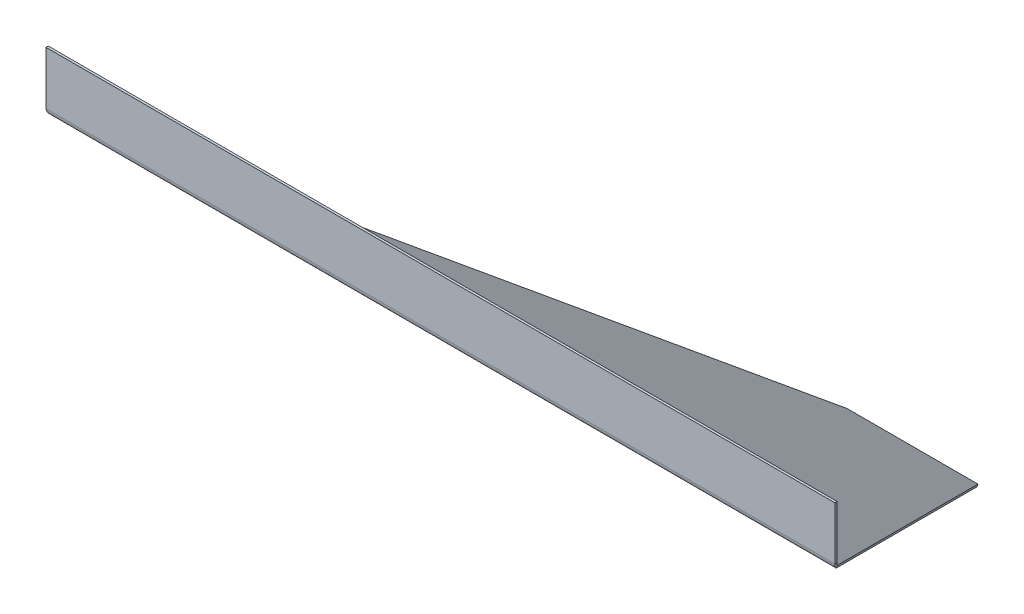
ISO-10303-21;
HEADER;
FILE_DESCRIPTION(('STEP AP214'),'2;1');
FILE_NAME('part.step','',(''),(''),'','','');
FILE_SCHEMA(('AUTOMOTIVE_DESIGN { 1 0 10303 214 1 1 1 1 }'));
ENDSEC;
DATA;
#1=APPLICATION_CONTEXT('core data for automotive mechanical design processes');
#2=APPLICATION_PROTOCOL_DEFINITION('international standard','automotive_design',2000,#1);
#3=PRODUCT_CONTEXT('',#1,'mechanical');
#4=PRODUCT('Part','Part','',(#3));
#5=PRODUCT_RELATED_PRODUCT_CATEGORY('part','',(#4));
#6=PRODUCT_DEFINITION_FORMATION('','',#4);
#7=PRODUCT_DEFINITION_CONTEXT('part definition',#1,'design');
#8=PRODUCT_DEFINITION('design','',#6,#7);
#9=PRODUCT_DEFINITION_SHAPE('','',#8);
#10=(LENGTH_UNIT() NAMED_UNIT(*) SI_UNIT(.MILLI.,.METRE.));
#11=(NAMED_UNIT(*) PLANE_ANGLE_UNIT() SI_UNIT($,.RADIAN.));
#12=(NAMED_UNIT(*) SI_UNIT($,.STERADIAN.) SOLID_ANGLE_UNIT());
#13=UNCERTAINTY_MEASURE_WITH_UNIT(LENGTH_MEASURE(1.E-05),#10,'distance_accuracy_value','');
#14=(GEOMETRIC_REPRESENTATION_CONTEXT(3) GLOBAL_UNCERTAINTY_ASSIGNED_CONTEXT((#13)) GLOBAL_UNIT_ASSIGNED_CONTEXT((#10,
#11,#12)) REPRESENTATION_CONTEXT('',''));
#15=CARTESIAN_POINT('',(0.,0.,0.));
#16=DIRECTION('',(0.,0.,1.));
#17=DIRECTION('',(1.,0.,0.));
#18=AXIS2_PLACEMENT_3D('',#15,#16,#17);
#19=CARTESIAN_POINT('',(-348.585786437627,341.373079461268,506.591069961946));
#20=DIRECTION('',(0.,-1.,0.));
#21=DIRECTION('',(-1.,0.,0.));
#22=AXIS2_PLACEMENT_3D('',#19,#20,#21);
#23=PLANE('',#22);
#24=DIRECTION('',(0.,0.,-1.));
#25=VECTOR('',#24,1.);
#26=CARTESIAN_POINT('',(-348.585786437627,341.373079461268,506.591069961946));
#27=LINE('',#26,#25);
#28=CARTESIAN_POINT('',(-348.58578643763,341.373079461271,508.591069961946));
#29=VERTEX_POINT('',#28);
#30=CARTESIAN_POINT('',(-348.585786437627,341.373079461268,506.591069961946));
#31=VERTEX_POINT('',#30);
#32=EDGE_CURVE('E11',#29,#31,#27,.T.);
#33=ORIENTED_EDGE('',*,*,#32,.F.);
#34=DIRECTION('',(-1.,0.,0.));
#35=VECTOR('',#34,1.);
#36=CARTESIAN_POINT('',(-4.49753559093629E-13,341.373079461271,508.591069961946));
#37=LINE('',#36,#35);
#38=CARTESIAN_POINT('',(348.585786437632,341.373079461271,508.591069961946));
#39=VERTEX_POINT('',#38);
#40=EDGE_CURVE('E127',#39,#29,#37,.T.);
#41=ORIENTED_EDGE('',*,*,#40,.F.);
#42=DIRECTION('',(0.,0.,-1.));
#43=VECTOR('',#42,1.);
#44=CARTESIAN_POINT('',(348.585786437629,341.373079461268,506.591069961946));
#45=LINE('',#44,#43);
#46=CARTESIAN_POINT('',(348.585786437629,341.373079461268,506.591069961946));
#47=VERTEX_POINT('',#46);
#48=EDGE_CURVE('E53',#39,#47,#45,.T.);
#49=ORIENTED_EDGE('',*,*,#48,.T.);
#50=DIRECTION('',(-1.,0.,0.));
#51=VECTOR('',#50,1.);
#52=CARTESIAN_POINT('',(-348.585786437627,341.373079461268,506.591069961946));
#53=LINE('',#52,#51);
#54=EDGE_CURVE('E275',#47,#31,#53,.T.);
#55=ORIENTED_EDGE('',*,*,#54,.T.);
#56=EDGE_LOOP('',(#33,#41,#49,#55));
#57=FACE_BOUND('',#56,.T.);
#58=ADVANCED_FACE('F41',(#57),#23,.F.);
#59=CARTESIAN_POINT('',(348.585786437629,341.373079461268,506.591069961946));
#60=DIRECTION('',(-1.,0.,0.));
#61=DIRECTION('',(0.,1.00000000000001,0.));
#62=AXIS2_PLACEMENT_3D('',#59,#60,#61);
#63=PLANE('',#62);
#64=ORIENTED_EDGE('',*,*,#48,.F.);
#65=DIRECTION('',(0.,1.,0.));
#66=VECTOR('',#65,1.);
#67=CARTESIAN_POINT('',(348.585786437632,4.64520581694614E-13,508.591069961946));
#68=LINE('',#67,#66);
#69=CARTESIAN_POINT('',(348.585786437632,294.496481764581,508.591069961946));
#70=VERTEX_POINT('',#69);
#71=EDGE_CURVE('E124',#70,#39,#68,.T.);
#72=ORIENTED_EDGE('',*,*,#71,.F.);
#73=CARTESIAN_POINT('',(348.585786437629,294.496481764578,506.591069961946));
#74=CARTESIAN_POINT('',(348.585786437629,294.496481764578,508.591069961946));
#75=B_SPLINE_CURVE_WITH_KNOTS('',1,(#73,#74),.UNSPECIFIED.,.F.,.F.,(2,2),(0.,1.),.UNSPECIFIED.);
#76=CARTESIAN_POINT('',(348.585786437629,294.496481764578,506.591069961946));
#77=VERTEX_POINT('',#76);
#78=EDGE_CURVE('E311',#70,#77,#75,.F.);
#79=ORIENTED_EDGE('',*,*,#78,.T.);
#80=DIRECTION('',(0.,1.00000000000001,0.));
#81=VECTOR('',#80,1.);
#82=CARTESIAN_POINT('',(348.585786437629,341.373079461268,506.591069961946));
#83=LINE('',#82,#81);
#84=EDGE_CURVE('E268',#77,#47,#83,.T.);
#85=ORIENTED_EDGE('',*,*,#84,.T.);
#86=EDGE_LOOP('',(#64,#72,#79,#85));
#87=FACE_BOUND('',#86,.T.);
#88=ADVANCED_FACE('F215',(#87),#63,.F.);
#89=CARTESIAN_POINT('',(348.585786437629,294.496481764578,508.591069961946));
#90=CARTESIAN_POINT('',(348.485436492231,294.012554067204,508.591069961946));
#91=CARTESIAN_POINT('',(348.38699472025,293.537935274434,508.533261804291));
#92=CARTESIAN_POINT('',(348.188787003119,292.609264735825,508.306563567173));
#93=CARTESIAN_POINT('',(348.088124454937,292.151718507256,508.134556651368));
#94=CARTESIAN_POINT('',(347.890023577001,291.30417653098,507.693750307043));
#95=CARTESIAN_POINT('',(347.791207752239,290.907523328618,507.423561507274));
#96=CARTESIAN_POINT('',(347.590781891389,290.180273574276,506.786775391155));
#97=CARTESIAN_POINT('',(347.491798716767,289.859145408828,506.428948062615));
#98=CARTESIAN_POINT('',(347.39144646268,289.581569498844,506.032528580053));
#99=CARTESIAN_POINT('',(348.585786437629,294.496481764578,506.591069961946));
#100=CARTESIAN_POINT('',(348.485436021493,294.173861786272,506.591069961946));
#101=CARTESIAN_POINT('',(348.38699472025,293.857450771148,506.552531190176));
#102=CARTESIAN_POINT('',(348.188787003119,293.238337078743,506.401399032097));
#103=CARTESIAN_POINT('',(348.088124454937,292.933306259697,506.286727754894));
#104=CARTESIAN_POINT('',(347.890023577001,292.368278275513,505.992856858677));
#105=CARTESIAN_POINT('',(347.791207752239,292.103842807271,505.812730992165));
#106=CARTESIAN_POINT('',(347.590781891389,291.61900963771,505.388206914752));
#107=CARTESIAN_POINT('',(347.491799476233,291.40492559454,505.14965736246));
#108=CARTESIAN_POINT('',(347.39144646268,291.219873587422,504.885375707351));
#109=B_SPLINE_SURFACE_WITH_KNOTS('',1,3,((#89,#90,#91,#92,#93,#94,#95,#96,#97,#98),(#99,#100,
#101,#102,#103,#104,#105,#106,#107,#108)),.UNSPECIFIED.,.F.,.F.,.F.,(2,2),(4,2,2,2,4),(0.,1.),
(0.,0.000999310380834157,0.00199862076166831,0.00299793114250247,0.00399724152333663),.UNSPECIFIED.);
#110=CARTESIAN_POINT('',(348.585786437629,294.496481764578,508.591069961946));
#111=CARTESIAN_POINT('',(348.485436492231,294.012554067204,508.591069961946));
#112=CARTESIAN_POINT('',(348.38699472025,293.537935274434,508.533261804291));
#113=CARTESIAN_POINT('',(348.188787003119,292.609264735825,508.306563567173));
#114=CARTESIAN_POINT('',(348.088124454937,292.151718507256,508.134556651368));
#115=CARTESIAN_POINT('',(347.890023577001,291.30417653098,507.693750307043));
#116=CARTESIAN_POINT('',(347.791207752239,290.907523328618,507.423561507274));
#117=CARTESIAN_POINT('',(347.590781891389,290.180273574276,506.786775391155));
#118=CARTESIAN_POINT('',(347.491798716767,289.859145408828,506.428948062615));
#119=CARTESIAN_POINT('',(347.39144646268,289.581569498844,506.032528580053));
#120=B_SPLINE_CURVE_WITH_KNOTS('',3,(#110,#111,#112,#113,#114,#115,#116,#117,#118,#119),
.UNSPECIFIED.,.F.,.F.,(4,2,2,2,4),(0.,0.000999310380834157,0.00199862076166831,
0.00299793114250247,0.00399724152333663),.UNSPECIFIED.);
#121=CARTESIAN_POINT('',(347.391446462684,289.581569498845,506.032528580055));
#122=VERTEX_POINT('',#121);
#123=EDGE_CURVE('E118',#70,#122,#120,.T.);
#124=CARTESIAN_POINT('',(347.39144646268,289.581569498844,506.032528580053));
#125=CARTESIAN_POINT('',(347.39144646268,291.219873587422,504.885375707351));
#126=B_SPLINE_CURVE_WITH_KNOTS('',1,(#124,#125),.UNSPECIFIED.,.F.,.F.,(2,2),(0.,1.),.UNSPECIFIED.);
#127=CARTESIAN_POINT('',(347.39144646268,291.219873587422,504.885375707351));
#128=VERTEX_POINT('',#127);
#129=EDGE_CURVE('E189',#122,#128,#126,.T.);
#130=CARTESIAN_POINT('',(347.39144646268,291.219873587422,504.885375707351));
#131=CARTESIAN_POINT('',(347.491799476233,291.40492559454,505.14965736246));
#132=CARTESIAN_POINT('',(347.590781891389,291.61900963771,505.388206914752));
#133=CARTESIAN_POINT('',(347.791207752239,292.103842807271,505.812730992165));
#134=CARTESIAN_POINT('',(347.890023577001,292.368278275513,505.992856858677));
#135=CARTESIAN_POINT('',(348.088124454937,292.933306259697,506.286727754894));
#136=CARTESIAN_POINT('',(348.188787003119,293.238337078743,506.401399032097));
#137=CARTESIAN_POINT('',(348.38699472025,293.857450771148,506.552531190176));
#138=CARTESIAN_POINT('',(348.485436021493,294.173861786272,506.591069961946));
#139=CARTESIAN_POINT('',(348.585786437629,294.496481764578,506.591069961946));
#140=B_SPLINE_CURVE_WITH_KNOTS('',3,(#130,#131,#132,#133,#134,#135,#136,#137,#138,#139),
.UNSPECIFIED.,.F.,.F.,(4,2,2,2,4),(0.,0.000999310380834157,0.00199862076166831,
0.00299793114250247,0.00399724152333663),.UNSPECIFIED.);
#141=EDGE_CURVE('E105',#77,#128,#140,.F.);
#142=ORIENTED_EDGE('',*,*,#78,.F.);
#143=ORIENTED_EDGE('',*,*,#123,.T.);
#144=ORIENTED_EDGE('',*,*,#129,.T.);
#145=ORIENTED_EDGE('',*,*,#141,.F.);
#146=EDGE_LOOP('',(#142,#143,#144,#145));
#147=FACE_BOUND('',#146,.T.);
#148=ADVANCED_FACE('F202',(#147),#109,.F.);
#149=CARTESIAN_POINT('',(348.585786437629,292.414213562371,506.591069961946));
#150=DIRECTION('',(-0.867439421552543,0.285378833133411,0.407563211705869));
#151=DIRECTION('',(-0.497542812164533,-0.497542812164527,-0.710564775461624));
#152=AXIS2_PLACEMENT_3D('',#149,#150,#151);
#153=PLANE('',#152);
#154=ORIENTED_EDGE('',*,*,#129,.F.);
#155=DIRECTION('',(-0.497542812164533,-0.497542812164527,-0.710564775461624));
#156=VECTOR('',#155,1.);
#157=CARTESIAN_POINT('',(348.585786437629,290.775909473793,507.738222834648));
#158=LINE('',#157,#156);
#159=CARTESIAN_POINT('',(57.8098769638315,-1.31085378051316E-12,92.4671873110305));
#160=VERTEX_POINT('',#159);
#161=EDGE_CURVE('E336',#122,#160,#158,.T.);
#162=ORIENTED_EDGE('',*,*,#161,.T.);
#163=DIRECTION('',(0.,0.819152044288994,-0.57357643635105));
#164=VECTOR('',#163,1.);
#165=CARTESIAN_POINT('',(57.8098769638321,1.63830408857796,91.3200344383293));
#166=LINE('',#165,#164);
#167=CARTESIAN_POINT('',(57.8098769638321,1.63830408857796,91.3200344383293));
#168=VERTEX_POINT('',#167);
#169=EDGE_CURVE('E184',#160,#168,#166,.T.);
#170=ORIENTED_EDGE('',*,*,#169,.T.);
#171=DIRECTION('',(-0.497542812164533,-0.497542812164527,-0.710564775461624));
#172=VECTOR('',#171,1.);
#173=CARTESIAN_POINT('',(348.585786437629,292.414213562371,506.591069961946));
#174=LINE('',#173,#172);
#175=EDGE_CURVE('E279',#128,#168,#174,.T.);
#176=ORIENTED_EDGE('',*,*,#175,.F.);
#177=EDGE_LOOP('',(#154,#162,#170,#176));
#178=FACE_BOUND('',#177,.T.);
#179=ADVANCED_FACE('F214',(#178),#153,.F.);
#180=CARTESIAN_POINT('',(57.8098769638321,1.63830408857796,91.3200344383293));
#181=DIRECTION('',(0.,0.573576436351048,0.81915204428899));
#182=DIRECTION('',(-1.,0.,0.));
#183=AXIS2_PLACEMENT_3D('',#180,#181,#182);
#184=PLANE('',#183);
#185=ORIENTED_EDGE('',*,*,#169,.F.);
#186=DIRECTION('',(1.00000000000001,0.,0.));
#187=VECTOR('',#186,1.);
#188=CARTESIAN_POINT('',(0.,-2.77555756156289E-13,92.4671873110319));
#189=LINE('',#188,#187);
#190=CARTESIAN_POINT('',(-57.8098769638325,-1.78176897405842E-13,92.4671873110316));
#191=VERTEX_POINT('',#190);
#192=EDGE_CURVE('E331',#160,#191,#189,.F.);
#193=ORIENTED_EDGE('',*,*,#192,.T.);
#194=DIRECTION('',(0.,0.819152044288994,-0.57357643635105));
#195=VECTOR('',#194,1.);
#196=CARTESIAN_POINT('',(-57.8098769638321,1.63830408857785,91.3200344383292));
#197=LINE('',#196,#195);
#198=CARTESIAN_POINT('',(-57.8098769638321,1.63830408857785,91.3200344383292));
#199=VERTEX_POINT('',#198);
#200=EDGE_CURVE('E176',#191,#199,#197,.T.);
#201=ORIENTED_EDGE('',*,*,#200,.T.);
#202=DIRECTION('',(-1.,0.,0.));
#203=VECTOR('',#202,1.);
#204=CARTESIAN_POINT('',(57.8098769638321,1.63830408857796,91.3200344383293));
#205=LINE('',#204,#203);
#206=EDGE_CURVE('E266',#168,#199,#205,.T.);
#207=ORIENTED_EDGE('',*,*,#206,.F.);
#208=EDGE_LOOP('',(#185,#193,#201,#207));
#209=FACE_BOUND('',#208,.T.);
#210=ADVANCED_FACE('F403',(#209),#184,.F.);
#211=CARTESIAN_POINT('',(-57.8098769638321,1.63830408857785,91.3200344383292));
#212=DIRECTION('',(0.867439421552543,0.28537883313341,0.407563211705869));
#213=DIRECTION('',(-0.497542812164532,0.497542812164526,0.710564775461624));
#214=AXIS2_PLACEMENT_3D('',#211,#212,#213);
#215=PLANE('',#214);
#216=ORIENTED_EDGE('',*,*,#200,.F.);
#217=DIRECTION('',(-0.497542812164532,0.497542812164526,0.710564775461624));
#218=VECTOR('',#217,1.);
#219=CARTESIAN_POINT('',(-57.8098769638321,-1.52872506320456E-13,92.4671873110313));
#220=LINE('',#219,#218);
#221=CARTESIAN_POINT('',(-347.391446462685,289.581569498844,506.032528580053));
#222=VERTEX_POINT('',#221);
#223=EDGE_CURVE('E255',#191,#222,#220,.T.);
#224=ORIENTED_EDGE('',*,*,#223,.T.);
#225=CARTESIAN_POINT('',(-347.391446462679,291.219873587422,504.885375707351));
#226=CARTESIAN_POINT('',(-347.391446462679,289.581569498844,506.032528580053));
#227=B_SPLINE_CURVE_WITH_KNOTS('',1,(#225,#226),.UNSPECIFIED.,.F.,.F.,(2,2),(0.,1.),.UNSPECIFIED.);
#228=CARTESIAN_POINT('',(-347.391446462679,291.219873587422,504.885375707351));
#229=VERTEX_POINT('',#228);
#230=EDGE_CURVE('E104',#222,#229,#227,.F.);
#231=ORIENTED_EDGE('',*,*,#230,.T.);
#232=DIRECTION('',(-0.497542812164532,0.497542812164526,0.710564775461624));
#233=VECTOR('',#232,1.);
#234=CARTESIAN_POINT('',(-57.8098769638321,1.63830408857785,91.3200344383292));
#235=LINE('',#234,#233);
#236=EDGE_CURVE('E253',#199,#229,#235,.T.);
#237=ORIENTED_EDGE('',*,*,#236,.F.);
#238=EDGE_LOOP('',(#216,#224,#231,#237));
#239=FACE_BOUND('',#238,.T.);
#240=ADVANCED_FACE('F158',(#239),#215,.F.);
#241=CARTESIAN_POINT('',(-347.391446462679,289.581569498844,506.032528580053));
#242=CARTESIAN_POINT('',(-347.491796408076,289.859139022955,506.428938942644));
#243=CARTESIAN_POINT('',(-347.590238180057,290.178722849258,506.784566499941));
#244=CARTESIAN_POINT('',(-347.788445897188,290.897086711709,507.41526010314));
#245=CARTESIAN_POINT('',(-347.88910844537,291.300424263671,507.691400917834));
#246=CARTESIAN_POINT('',(-348.087209323307,292.147641788171,508.132830528222));
#247=CARTESIAN_POINT('',(-348.186025148069,292.596478426124,508.302775880898));
#248=CARTESIAN_POINT('',(-348.386451008918,293.535236397351,508.533258492674));
#249=CARTESIAN_POINT('',(-348.485434183539,294.012542933775,508.591069961946));
#250=CARTESIAN_POINT('',(-348.585786437628,294.496481764579,508.591069961946));
#251=CARTESIAN_POINT('',(-347.391446462679,291.219873587422,504.885375707351));
#252=CARTESIAN_POINT('',(-347.491796878814,291.404920804875,505.149650522109));
#253=CARTESIAN_POINT('',(-347.590238180057,291.617975821031,505.386734320609));
#254=CARTESIAN_POINT('',(-347.788445897188,292.096885062665,505.807196722742));
#255=CARTESIAN_POINT('',(-347.88910844537,292.365776763973,505.991290599205));
#256=CARTESIAN_POINT('',(-348.087209323307,292.930588446973,506.28557700613));
#257=CARTESIAN_POINT('',(-348.186025148069,293.229812872275,506.398873907914));
#258=CARTESIAN_POINT('',(-348.386451008918,293.85565151976,506.552528982432));
#259=CARTESIAN_POINT('',(-348.485433424074,294.173853435745,506.591069961946));
#260=CARTESIAN_POINT('',(-348.585786437628,294.496481764578,506.591069961946));
#261=B_SPLINE_SURFACE_WITH_KNOTS('',1,3,((#241,#242,#243,#244,#245,#246,#247,#248,#249,#250),
(#251,#252,#253,#254,#255,#256,#257,#258,#259,#260)),.UNSPECIFIED.,.F.,.F.,.F.,(2,2),(4,2,2,2,
4),(0.,1.),(0.,0.000999310380834153,0.00199862076166831,0.00299793114250246,
0.00399724152333661),.UNSPECIFIED.);
#262=CARTESIAN_POINT('',(-347.391446462679,289.581569498844,506.032528580053));
#263=CARTESIAN_POINT('',(-347.491796408076,289.859139022955,506.428938942644));
#264=CARTESIAN_POINT('',(-347.590238180057,290.178722849258,506.784566499941));
#265=CARTESIAN_POINT('',(-347.788445897188,290.897086711709,507.41526010314));
#266=CARTESIAN_POINT('',(-347.88910844537,291.300424263671,507.691400917834));
#267=CARTESIAN_POINT('',(-348.087209323307,292.147641788171,508.132830528222));
#268=CARTESIAN_POINT('',(-348.186025148069,292.596478426124,508.302775880898));
#269=CARTESIAN_POINT('',(-348.386451008918,293.535236397351,508.533258492674));
#270=CARTESIAN_POINT('',(-348.485434183539,294.012542933775,508.591069961946));
#271=CARTESIAN_POINT('',(-348.585786437628,294.496481764579,508.591069961946));
#272=B_SPLINE_CURVE_WITH_KNOTS('',3,(#262,#263,#264,#265,#266,#267,#268,#269,#270,#271),
.UNSPECIFIED.,.F.,.F.,(4,2,2,2,4),(0.,0.000999310380834153,0.00199862076166831,
0.00299793114250246,0.00399724152333661),.UNSPECIFIED.);
#273=CARTESIAN_POINT('',(-348.585786437631,294.496481764581,508.591069961946));
#274=VERTEX_POINT('',#273);
#275=EDGE_CURVE('E114',#222,#274,#272,.T.);
#276=CARTESIAN_POINT('',(-348.585786437628,294.496481764579,508.591069961946));
#277=CARTESIAN_POINT('',(-348.585786437628,294.496481764578,506.591069961946));
#278=B_SPLINE_CURVE_WITH_KNOTS('',1,(#276,#277),.UNSPECIFIED.,.F.,.F.,(2,2),(0.,1.),.UNSPECIFIED.);
#279=CARTESIAN_POINT('',(-348.585786437628,294.496481764578,506.591069961946));
#280=VERTEX_POINT('',#279);
#281=EDGE_CURVE('E92',#274,#280,#278,.T.);
#282=CARTESIAN_POINT('',(-348.585786437628,294.496481764578,506.591069961946));
#283=CARTESIAN_POINT('',(-348.485433424074,294.173853435745,506.591069961946));
#284=CARTESIAN_POINT('',(-348.386451008918,293.85565151976,506.552528982432));
#285=CARTESIAN_POINT('',(-348.186025148069,293.229812872275,506.398873907914));
#286=CARTESIAN_POINT('',(-348.087209323307,292.930588446973,506.28557700613));
#287=CARTESIAN_POINT('',(-347.88910844537,292.365776763973,505.991290599205));
#288=CARTESIAN_POINT('',(-347.788445897188,292.096885062665,505.807196722742));
#289=CARTESIAN_POINT('',(-347.590238180057,291.617975821031,505.386734320609));
#290=CARTESIAN_POINT('',(-347.491796878814,291.404920804875,505.149650522109));
#291=CARTESIAN_POINT('',(-347.391446462679,291.219873587422,504.885375707351));
#292=B_SPLINE_CURVE_WITH_KNOTS('',3,(#282,#283,#284,#285,#286,#287,#288,#289,#290,#291),
.UNSPECIFIED.,.F.,.F.,(4,2,2,2,4),(0.,0.000999310380834153,0.00199862076166831,
0.00299793114250246,0.00399724152333661),.UNSPECIFIED.);
#293=EDGE_CURVE('E270',#229,#280,#292,.F.);
#294=ORIENTED_EDGE('',*,*,#230,.F.);
#295=ORIENTED_EDGE('',*,*,#275,.T.);
#296=ORIENTED_EDGE('',*,*,#281,.T.);
#297=ORIENTED_EDGE('',*,*,#293,.F.);
#298=EDGE_LOOP('',(#294,#295,#296,#297));
#299=FACE_BOUND('',#298,.T.);
#300=ADVANCED_FACE('F131',(#299),#261,.F.);
#301=CARTESIAN_POINT('',(-348.585786437627,292.414213562371,506.591069961946));
#302=DIRECTION('',(1.,0.,0.));
#303=DIRECTION('',(0.,-1.00000000000001,0.));
#304=AXIS2_PLACEMENT_3D('',#301,#302,#303);
#305=PLANE('',#304);
#306=DIRECTION('',(0.,1.,0.));
#307=VECTOR('',#306,1.);
#308=CARTESIAN_POINT('',(-348.58578643763,-4.64298537089686E-13,508.591069961946));
#309=LINE('',#308,#307);
#310=EDGE_CURVE('E95',#29,#274,#309,.F.);
#311=ORIENTED_EDGE('',*,*,#310,.F.);
#312=ORIENTED_EDGE('',*,*,#32,.T.);
#313=DIRECTION('',(0.,-1.00000000000001,0.));
#314=VECTOR('',#313,1.);
#315=CARTESIAN_POINT('',(-348.585786437627,292.414213562371,506.591069961946));
#316=LINE('',#315,#314);
#317=EDGE_CURVE('E97',#31,#280,#316,.T.);
#318=ORIENTED_EDGE('',*,*,#317,.T.);
#319=ORIENTED_EDGE('',*,*,#281,.F.);
#320=EDGE_LOOP('',(#311,#312,#318,#319));
#321=FACE_BOUND('',#320,.T.);
#322=ADVANCED_FACE('F43',(#321),#305,.F.);
#323=CARTESIAN_POINT('',(348.585786437629,294.496481764578,502.591069961946));
#324=DIRECTION('',(1.,0.,0.));
#325=DIRECTION('',(0.,0.,1.));
#326=AXIS2_PLACEMENT_3D('',#323,#324,#325);
#327=CYLINDRICAL_SURFACE('',#326,4.);
#328=DIRECTION('',(1.,0.,0.));
#329=VECTOR('',#328,1.);
#330=CARTESIAN_POINT('',(348.585786437629,291.219873587422,504.88537570735));
#331=LINE('',#330,#329);
#332=EDGE_CURVE('E264',#128,#229,#331,.F.);
#333=ORIENTED_EDGE('',*,*,#332,.T.);
#334=ORIENTED_EDGE('',*,*,#293,.T.);
#335=DIRECTION('',(1.,0.,0.));
#336=VECTOR('',#335,1.);
#337=CARTESIAN_POINT('',(-348.585786437628,294.496481764578,506.591069961946));
#338=LINE('',#337,#336);
#339=EDGE_CURVE('E294',#280,#77,#338,.T.);
#340=ORIENTED_EDGE('',*,*,#339,.T.);
#341=ORIENTED_EDGE('',*,*,#141,.T.);
#342=EDGE_LOOP('',(#333,#334,#340,#341));
#343=FACE_BOUND('',#342,.T.);
#344=ADVANCED_FACE('F277',(#343),#327,.F.);
#345=CARTESIAN_POINT('',(0.,0.,506.591069961946));
#346=DIRECTION('',(0.,0.,-1.));
#347=DIRECTION('',(-1.,0.,0.));
#348=AXIS2_PLACEMENT_3D('',#345,#346,#347);
#349=PLANE('',#348);
#350=ORIENTED_EDGE('',*,*,#84,.F.);
#351=ORIENTED_EDGE('',*,*,#339,.F.);
#352=ORIENTED_EDGE('',*,*,#317,.F.);
#353=ORIENTED_EDGE('',*,*,#54,.F.);
#354=EDGE_LOOP('',(#350,#351,#352,#353));
#355=FACE_BOUND('',#354,.T.);
#356=ADVANCED_FACE('F395',(#355),#349,.T.);
#357=CARTESIAN_POINT('',(0.,-41.8070627019251,29.273620454294));
#358=DIRECTION('',(0.,-0.819152044288994,0.57357643635105));
#359=DIRECTION('',(0.,-0.573576436351053,-0.819152044288989));
#360=AXIS2_PLACEMENT_3D('',#357,#358,#359);
#361=PLANE('',#360);
#362=ORIENTED_EDGE('',*,*,#332,.F.);
#363=ORIENTED_EDGE('',*,*,#175,.T.);
#364=ORIENTED_EDGE('',*,*,#206,.T.);
#365=ORIENTED_EDGE('',*,*,#236,.T.);
#366=EDGE_LOOP('',(#362,#363,#364,#365));
#367=FACE_BOUND('',#366,.T.);
#368=ADVANCED_FACE('F261',(#367),#361,.F.);
#369=CARTESIAN_POINT('',(348.585786437629,294.496481764578,502.591069961946));
#370=DIRECTION('',(1.,0.,0.));
#371=DIRECTION('',(0.,0.,1.));
#372=AXIS2_PLACEMENT_3D('',#369,#370,#371);
#373=CYLINDRICAL_SURFACE('',#372,6.);
#374=DIRECTION('',(1.,0.,0.));
#375=VECTOR('',#374,1.);
#376=CARTESIAN_POINT('',(348.585786437629,289.581569498844,506.032528580053));
#377=LINE('',#376,#375);
#378=EDGE_CURVE('E341',#122,#222,#377,.F.);
#379=ORIENTED_EDGE('',*,*,#378,.F.);
#380=ORIENTED_EDGE('',*,*,#123,.F.);
#381=DIRECTION('',(1.,0.,0.));
#382=VECTOR('',#381,1.);
#383=CARTESIAN_POINT('',(348.585786437629,294.49648176458,508.591069961946));
#384=LINE('',#383,#382);
#385=EDGE_CURVE('E111',#274,#70,#384,.T.);
#386=ORIENTED_EDGE('',*,*,#385,.F.);
#387=ORIENTED_EDGE('',*,*,#275,.F.);
#388=EDGE_LOOP('',(#379,#380,#386,#387));
#389=FACE_BOUND('',#388,.T.);
#390=ADVANCED_FACE('F113',(#389),#373,.T.);
#391=CARTESIAN_POINT('',(0.,0.,508.591069961946));
#392=DIRECTION('',(0.,0.,-1.));
#393=DIRECTION('',(-1.,0.,0.));
#394=AXIS2_PLACEMENT_3D('',#391,#392,#393);
#395=PLANE('',#394);
#396=ORIENTED_EDGE('',*,*,#71,.T.);
#397=ORIENTED_EDGE('',*,*,#40,.T.);
#398=ORIENTED_EDGE('',*,*,#310,.T.);
#399=ORIENTED_EDGE('',*,*,#385,.T.);
#400=EDGE_LOOP('',(#396,#397,#398,#399));
#401=FACE_BOUND('',#400,.T.);
#402=ADVANCED_FACE('F126',(#401),#395,.F.);
#403=CARTESIAN_POINT('',(0.,-43.4453667905031,30.4207733269961));
#404=DIRECTION('',(0.,-0.819152044288994,0.57357643635105));
#405=DIRECTION('',(0.,-0.573576436351053,-0.819152044288989));
#406=AXIS2_PLACEMENT_3D('',#403,#404,#405);
#407=PLANE('',#406);
#408=ORIENTED_EDGE('',*,*,#378,.T.);
#409=ORIENTED_EDGE('',*,*,#223,.F.);
#410=ORIENTED_EDGE('',*,*,#192,.F.);
#411=ORIENTED_EDGE('',*,*,#161,.F.);
#412=EDGE_LOOP('',(#408,#409,#410,#411));
#413=FACE_BOUND('',#412,.T.);
#414=ADVANCED_FACE('F159',(#413),#407,.T.);
#415=CLOSED_SHELL('',(#58,#88,#148,#179,#210,#240,#300,#322,#344,#356,#368,#390,#402,#414));
#416=MANIFOLD_SOLID_BREP('B2',#415);
#417=ADVANCED_BREP_SHAPE_REPRESENTATION('',(#18,#416),#14);
#418=SHAPE_DEFINITION_REPRESENTATION(#9,#417);
ENDSEC;
END-ISO-10303-21;
